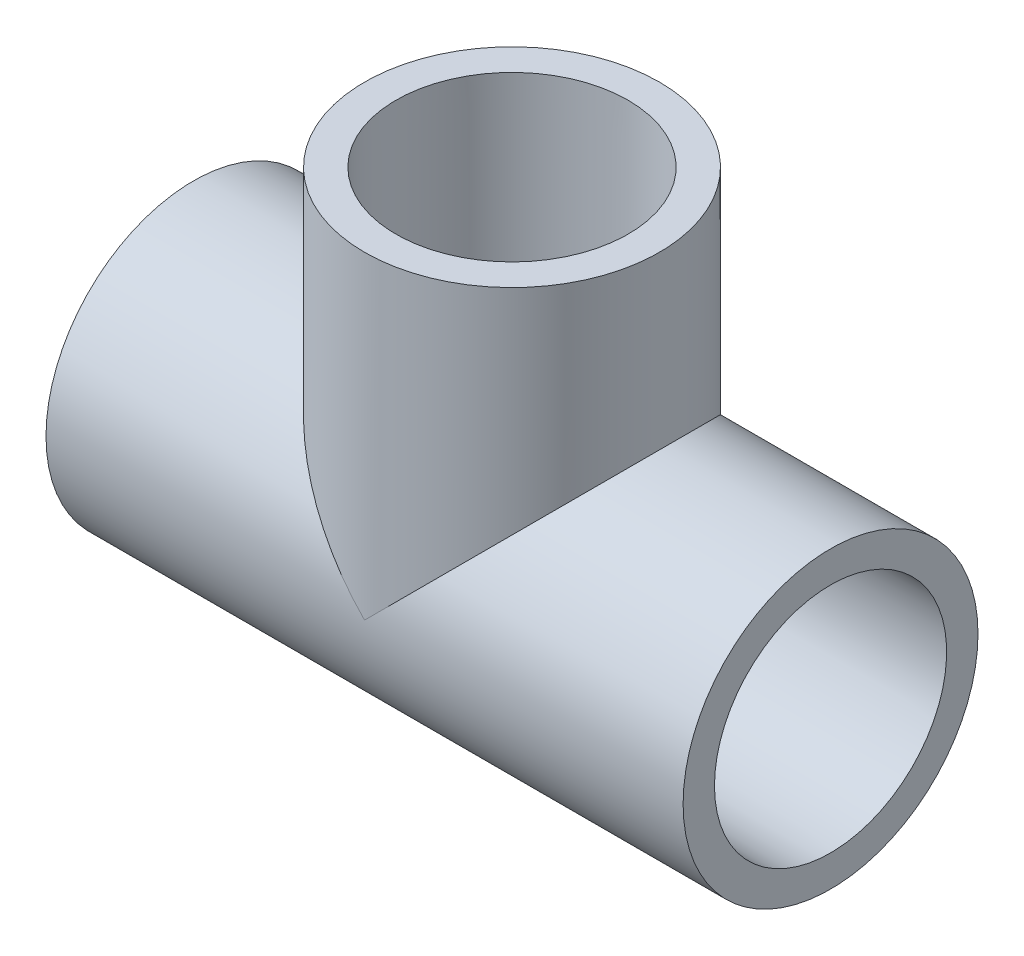
ISO-10303-21;
HEADER;
FILE_DESCRIPTION(('STEP AP214'),'2;1');
FILE_NAME('part.step','',(''),(''),'','','');
FILE_SCHEMA(('AUTOMOTIVE_DESIGN { 1 0 10303 214 1 1 1 1 }'));
ENDSEC;
DATA;
#1=APPLICATION_CONTEXT('core data for automotive mechanical design processes');
#2=APPLICATION_PROTOCOL_DEFINITION('international standard','automotive_design',2000,#1);
#3=PRODUCT_CONTEXT('',#1,'mechanical');
#4=PRODUCT('Part','Part','',(#3));
#5=PRODUCT_RELATED_PRODUCT_CATEGORY('part','',(#4));
#6=PRODUCT_DEFINITION_FORMATION('','',#4);
#7=PRODUCT_DEFINITION_CONTEXT('part definition',#1,'design');
#8=PRODUCT_DEFINITION('design','',#6,#7);
#9=PRODUCT_DEFINITION_SHAPE('','',#8);
#10=(LENGTH_UNIT() NAMED_UNIT(*) SI_UNIT(.MILLI.,.METRE.));
#11=(NAMED_UNIT(*) PLANE_ANGLE_UNIT() SI_UNIT($,.RADIAN.));
#12=(NAMED_UNIT(*) SI_UNIT($,.STERADIAN.) SOLID_ANGLE_UNIT());
#13=UNCERTAINTY_MEASURE_WITH_UNIT(LENGTH_MEASURE(1.E-05),#10,'distance_accuracy_value','');
#14=(GEOMETRIC_REPRESENTATION_CONTEXT(3) GLOBAL_UNCERTAINTY_ASSIGNED_CONTEXT((#13)) GLOBAL_UNIT_ASSIGNED_CONTEXT((#10,
#11,#12)) REPRESENTATION_CONTEXT('',''));
#15=CARTESIAN_POINT('',(0.,0.,0.));
#16=DIRECTION('',(0.,0.,1.));
#17=DIRECTION('',(1.,0.,0.));
#18=AXIS2_PLACEMENT_3D('',#15,#16,#17);
#19=CARTESIAN_POINT('',(-46.1772,0.,0.));
#20=DIRECTION('',(-1.,0.,0.));
#21=DIRECTION('',(0.,0.,1.));
#22=AXIS2_PLACEMENT_3D('',#19,#20,#21);
#23=CYLINDRICAL_SURFACE('',#22,21.3741);
#24=CARTESIAN_POINT('',(-46.1772,0.,0.));
#25=DIRECTION('',(-1.,0.,0.));
#26=DIRECTION('',(0.,0.,1.));
#27=AXIS2_PLACEMENT_3D('',#24,#25,#26);
#28=CIRCLE('',#27,21.3741);
#29=CARTESIAN_POINT('',(-46.1772,0.,21.3741));
#30=VERTEX_POINT('',#29);
#31=EDGE_CURVE('E94',#30,#30,#28,.T.);
#32=ORIENTED_EDGE('',*,*,#31,.F.);
#33=EDGE_LOOP('',(#32));
#34=FACE_BOUND('',#33,.T.);
#35=CARTESIAN_POINT('',(46.1772,0.,0.));
#36=DIRECTION('',(-1.,0.,0.));
#37=DIRECTION('',(0.,0.,1.));
#38=AXIS2_PLACEMENT_3D('',#35,#36,#37);
#39=CIRCLE('',#38,21.3741);
#40=CARTESIAN_POINT('',(46.1772,0.,21.3741));
#41=VERTEX_POINT('',#40);
#42=EDGE_CURVE('E72',#41,#41,#39,.T.);
#43=ORIENTED_EDGE('',*,*,#42,.T.);
#44=EDGE_LOOP('',(#43));
#45=FACE_BOUND('',#44,.T.);
#46=CARTESIAN_POINT('',(0.,0.,0.));
#47=DIRECTION('',(-0.707106781186547,-0.707106781186547,0.));
#48=DIRECTION('',(-0.707106781186547,0.707106781186547,0.));
#49=AXIS2_PLACEMENT_3D('',#46,#47,#48);
#50=ELLIPSE('',#49,30.2275421035188,21.3741);
#51=CARTESIAN_POINT('',(0.,0.,-21.3741));
#52=VERTEX_POINT('',#51);
#53=CARTESIAN_POINT('',(0.,0.,21.3741));
#54=VERTEX_POINT('',#53);
#55=EDGE_CURVE('E49',#52,#54,#50,.F.);
#56=ORIENTED_EDGE('',*,*,#55,.F.);
#57=CARTESIAN_POINT('',(0.,0.,0.));
#58=DIRECTION('',(0.707106781186547,-0.707106781186547,0.));
#59=DIRECTION('',(-0.707106781186547,-0.707106781186547,0.));
#60=AXIS2_PLACEMENT_3D('',#57,#58,#59);
#61=ELLIPSE('',#60,30.2275421035188,21.3741);
#62=EDGE_CURVE('E85',#52,#54,#61,.T.);
#63=ORIENTED_EDGE('',*,*,#62,.T.);
#64=EDGE_LOOP('',(#56,#63));
#65=FACE_BOUND('',#64,.T.);
#66=ADVANCED_FACE('F30',(#34,#45,#65),#23,.T.);
#67=CARTESIAN_POINT('',(-46.1772,-21.3741,0.));
#68=DIRECTION('',(-1.,0.,0.));
#69=DIRECTION('',(0.,0.,1.));
#70=AXIS2_PLACEMENT_3D('',#67,#68,#69);
#71=PLANE('',#70);
#72=ORIENTED_EDGE('',*,*,#31,.T.);
#73=EDGE_LOOP('',(#72));
#74=FACE_BOUND('',#73,.T.);
#75=CARTESIAN_POINT('',(-46.1772,0.,0.));
#76=DIRECTION('',(-1.,0.,0.));
#77=DIRECTION('',(0.,0.,1.));
#78=AXIS2_PLACEMENT_3D('',#75,#76,#77);
#79=CIRCLE('',#78,16.8275);
#80=CARTESIAN_POINT('',(-46.1772,0.,16.8275));
#81=VERTEX_POINT('',#80);
#82=EDGE_CURVE('E102',#81,#81,#79,.T.);
#83=ORIENTED_EDGE('',*,*,#82,.F.);
#84=EDGE_LOOP('',(#83));
#85=FACE_BOUND('',#84,.T.);
#86=ADVANCED_FACE('F32',(#74,#85),#71,.T.);
#87=CARTESIAN_POINT('',(-17.4752,0.,0.));
#88=DIRECTION('',(-1.,0.,0.));
#89=DIRECTION('',(0.,0.,1.));
#90=AXIS2_PLACEMENT_3D('',#87,#88,#89);
#91=CONICAL_SURFACE('',#90,16.637,0.00663707068398975);
#92=ORIENTED_EDGE('',*,*,#82,.T.);
#93=EDGE_LOOP('',(#92));
#94=FACE_BOUND('',#93,.T.);
#95=CARTESIAN_POINT('',(-17.4752,0.,0.));
#96=DIRECTION('',(-1.,0.,0.));
#97=DIRECTION('',(0.,0.,1.));
#98=AXIS2_PLACEMENT_3D('',#95,#96,#97);
#99=CIRCLE('',#98,16.637);
#100=CARTESIAN_POINT('',(-17.4752,0.,16.637));
#101=VERTEX_POINT('',#100);
#102=EDGE_CURVE('E99',#101,#101,#99,.T.);
#103=ORIENTED_EDGE('',*,*,#102,.F.);
#104=EDGE_LOOP('',(#103));
#105=FACE_BOUND('',#104,.T.);
#106=ADVANCED_FACE('F136',(#94,#105),#91,.F.);
#107=CARTESIAN_POINT('',(75.2391741857328,17.4752,-12.3072960381231));
#108=DIRECTION('',(0.,-1.,0.));
#109=DIRECTION('',(0.,0.,-1.));
#110=AXIS2_PLACEMENT_3D('',#107,#108,#109);
#111=PLANE('',#110);
#112=CARTESIAN_POINT('',(0.,17.4752,0.));
#113=DIRECTION('',(0.,1.,0.));
#114=DIRECTION('',(0.,0.,1.));
#115=AXIS2_PLACEMENT_3D('',#112,#113,#114);
#116=CIRCLE('',#115,12.1539);
#117=CARTESIAN_POINT('',(0.,17.4752,12.1539));
#118=VERTEX_POINT('',#117);
#119=EDGE_CURVE('E70',#118,#118,#116,.T.);
#120=ORIENTED_EDGE('',*,*,#119,.F.);
#121=EDGE_LOOP('',(#120));
#122=FACE_BOUND('',#121,.T.);
#123=CARTESIAN_POINT('',(0.,17.4752,0.));
#124=DIRECTION('',(0.,-1.,0.));
#125=DIRECTION('',(0.,0.,-1.));
#126=AXIS2_PLACEMENT_3D('',#123,#124,#125);
#127=CIRCLE('',#126,16.637);
#128=CARTESIAN_POINT('',(0.,17.4752,-16.637));
#129=VERTEX_POINT('',#128);
#130=EDGE_CURVE('E56',#129,#129,#127,.F.);
#131=ORIENTED_EDGE('',*,*,#130,.T.);
#132=EDGE_LOOP('',(#131));
#133=FACE_BOUND('',#132,.T.);
#134=ADVANCED_FACE('F108',(#122,#133),#111,.F.);
#135=CARTESIAN_POINT('',(-17.4752,0.,0.));
#136=DIRECTION('',(1.,0.,0.));
#137=DIRECTION('',(0.,0.,-1.));
#138=AXIS2_PLACEMENT_3D('',#135,#136,#137);
#139=PLANE('',#138);
#140=CARTESIAN_POINT('',(-17.4752,0.,0.));
#141=DIRECTION('',(-1.,0.,0.));
#142=DIRECTION('',(0.,0.,1.));
#143=AXIS2_PLACEMENT_3D('',#140,#141,#142);
#144=CIRCLE('',#143,12.1539);
#145=CARTESIAN_POINT('',(-17.4752,0.,12.1539));
#146=VERTEX_POINT('',#145);
#147=EDGE_CURVE('E68',#146,#146,#144,.T.);
#148=ORIENTED_EDGE('',*,*,#147,.F.);
#149=EDGE_LOOP('',(#148));
#150=FACE_BOUND('',#149,.T.);
#151=ORIENTED_EDGE('',*,*,#102,.T.);
#152=EDGE_LOOP('',(#151));
#153=FACE_BOUND('',#152,.T.);
#154=ADVANCED_FACE('F121',(#150,#153),#139,.F.);
#155=CARTESIAN_POINT('',(21.3741,46.1772,0.));
#156=DIRECTION('',(0.,1.,0.));
#157=DIRECTION('',(0.,0.,1.));
#158=AXIS2_PLACEMENT_3D('',#155,#156,#157);
#159=PLANE('',#158);
#160=CARTESIAN_POINT('',(0.,46.1772,0.));
#161=DIRECTION('',(0.,-1.,0.));
#162=DIRECTION('',(0.,0.,-1.));
#163=AXIS2_PLACEMENT_3D('',#160,#161,#162);
#164=CIRCLE('',#163,16.8275);
#165=CARTESIAN_POINT('',(0.,46.1772,-16.8275));
#166=VERTEX_POINT('',#165);
#167=EDGE_CURVE('E87',#166,#166,#164,.T.);
#168=ORIENTED_EDGE('',*,*,#167,.T.);
#169=EDGE_LOOP('',(#168));
#170=FACE_BOUND('',#169,.T.);
#171=CARTESIAN_POINT('',(0.,46.1772,0.));
#172=DIRECTION('',(0.,-1.,0.));
#173=DIRECTION('',(0.,0.,-1.));
#174=AXIS2_PLACEMENT_3D('',#171,#172,#173);
#175=CIRCLE('',#174,21.3741);
#176=CARTESIAN_POINT('',(0.,46.1772,-21.3741));
#177=VERTEX_POINT('',#176);
#178=EDGE_CURVE('E90',#177,#177,#175,.T.);
#179=ORIENTED_EDGE('',*,*,#178,.F.);
#180=EDGE_LOOP('',(#179));
#181=FACE_BOUND('',#180,.T.);
#182=ADVANCED_FACE('F118',(#170,#181),#159,.T.);
#183=CARTESIAN_POINT('',(0.,0.,0.));
#184=DIRECTION('',(0.,-1.,0.));
#185=DIRECTION('',(0.,0.,-1.));
#186=AXIS2_PLACEMENT_3D('',#183,#184,#185);
#187=CYLINDRICAL_SURFACE('',#186,21.3741);
#188=ORIENTED_EDGE('',*,*,#62,.F.);
#189=ORIENTED_EDGE('',*,*,#55,.T.);
#190=EDGE_LOOP('',(#188,#189));
#191=FACE_BOUND('',#190,.T.);
#192=ORIENTED_EDGE('',*,*,#178,.T.);
#193=EDGE_LOOP('',(#192));
#194=FACE_BOUND('',#193,.T.);
#195=ADVANCED_FACE('F114',(#191,#194),#187,.T.);
#196=CARTESIAN_POINT('',(0.,46.1772,0.));
#197=DIRECTION('',(0.,1.,0.));
#198=DIRECTION('',(0.,0.,1.));
#199=AXIS2_PLACEMENT_3D('',#196,#197,#198);
#200=CONICAL_SURFACE('',#199,16.8275,0.00663707068398975);
#201=ORIENTED_EDGE('',*,*,#130,.F.);
#202=EDGE_LOOP('',(#201));
#203=FACE_BOUND('',#202,.T.);
#204=ORIENTED_EDGE('',*,*,#167,.F.);
#205=EDGE_LOOP('',(#204));
#206=FACE_BOUND('',#205,.T.);
#207=ADVANCED_FACE('F110',(#203,#206),#200,.F.);
#208=CARTESIAN_POINT('',(46.1772,-21.3741,0.));
#209=DIRECTION('',(1.,0.,0.));
#210=DIRECTION('',(0.,0.,1.));
#211=AXIS2_PLACEMENT_3D('',#208,#209,#210);
#212=PLANE('',#211);
#213=ORIENTED_EDGE('',*,*,#42,.F.);
#214=EDGE_LOOP('',(#213));
#215=FACE_BOUND('',#214,.T.);
#216=CARTESIAN_POINT('',(46.1772,0.,0.));
#217=DIRECTION('',(-1.,0.,0.));
#218=DIRECTION('',(0.,0.,1.));
#219=AXIS2_PLACEMENT_3D('',#216,#217,#218);
#220=CIRCLE('',#219,16.8275);
#221=CARTESIAN_POINT('',(46.1772,0.,16.8275));
#222=VERTEX_POINT('',#221);
#223=EDGE_CURVE('E82',#222,#222,#220,.T.);
#224=ORIENTED_EDGE('',*,*,#223,.T.);
#225=EDGE_LOOP('',(#224));
#226=FACE_BOUND('',#225,.T.);
#227=ADVANCED_FACE('F113',(#215,#226),#212,.T.);
#228=CARTESIAN_POINT('',(17.4752,0.,0.));
#229=DIRECTION('',(1.,0.,0.));
#230=DIRECTION('',(0.,0.,1.));
#231=AXIS2_PLACEMENT_3D('',#228,#229,#230);
#232=CONICAL_SURFACE('',#231,16.637,0.00663707068398975);
#233=ORIENTED_EDGE('',*,*,#223,.F.);
#234=EDGE_LOOP('',(#233));
#235=FACE_BOUND('',#234,.T.);
#236=CARTESIAN_POINT('',(17.4752,0.,0.));
#237=DIRECTION('',(-1.,0.,0.));
#238=DIRECTION('',(0.,0.,1.));
#239=AXIS2_PLACEMENT_3D('',#236,#237,#238);
#240=CIRCLE('',#239,16.637);
#241=CARTESIAN_POINT('',(17.4752,0.,16.637));
#242=VERTEX_POINT('',#241);
#243=EDGE_CURVE('E79',#242,#242,#240,.T.);
#244=ORIENTED_EDGE('',*,*,#243,.T.);
#245=EDGE_LOOP('',(#244));
#246=FACE_BOUND('',#245,.T.);
#247=ADVANCED_FACE('F157',(#235,#246),#232,.F.);
#248=CARTESIAN_POINT('',(17.4752,-21.3741,0.));
#249=DIRECTION('',(-1.,0.,0.));
#250=DIRECTION('',(0.,0.,-1.));
#251=AXIS2_PLACEMENT_3D('',#248,#249,#250);
#252=PLANE('',#251);
#253=CARTESIAN_POINT('',(17.4752,0.,0.));
#254=DIRECTION('',(-1.,0.,0.));
#255=DIRECTION('',(0.,0.,1.));
#256=AXIS2_PLACEMENT_3D('',#253,#254,#255);
#257=CIRCLE('',#256,12.1539);
#258=CARTESIAN_POINT('',(17.4752,0.,12.1539));
#259=VERTEX_POINT('',#258);
#260=EDGE_CURVE('E65',#259,#259,#257,.F.);
#261=ORIENTED_EDGE('',*,*,#260,.F.);
#262=EDGE_LOOP('',(#261));
#263=FACE_BOUND('',#262,.T.);
#264=ORIENTED_EDGE('',*,*,#243,.F.);
#265=EDGE_LOOP('',(#264));
#266=FACE_BOUND('',#265,.T.);
#267=ADVANCED_FACE('F60',(#263,#266),#252,.F.);
#268=CARTESIAN_POINT('',(51.8516204314527,0.,0.));
#269=DIRECTION('',(-1.,0.,0.));
#270=DIRECTION('',(0.,0.,1.));
#271=AXIS2_PLACEMENT_3D('',#268,#269,#270);
#272=CYLINDRICAL_SURFACE('',#271,12.1539);
#273=CARTESIAN_POINT('',(0.,0.,0.));
#274=DIRECTION('',(-0.707106781186547,-0.707106781186547,0.));
#275=DIRECTION('',(-0.707106781186547,0.707106781186547,0.));
#276=AXIS2_PLACEMENT_3D('',#273,#274,#275);
#277=ELLIPSE('',#276,17.1882102157264,12.1539);
#278=CARTESIAN_POINT('',(0.,0.,-12.1539));
#279=VERTEX_POINT('',#278);
#280=CARTESIAN_POINT('',(0.,0.,12.1539));
#281=VERTEX_POINT('',#280);
#282=EDGE_CURVE('E38',#279,#281,#277,.F.);
#283=ORIENTED_EDGE('',*,*,#282,.T.);
#284=CARTESIAN_POINT('',(0.,0.,0.));
#285=DIRECTION('',(-0.707106781186547,0.707106781186547,0.));
#286=DIRECTION('',(-0.707106781186547,-0.707106781186547,0.));
#287=AXIS2_PLACEMENT_3D('',#284,#285,#286);
#288=ELLIPSE('',#287,17.1882102157264,12.1539);
#289=EDGE_CURVE('E11',#281,#279,#288,.T.);
#290=ORIENTED_EDGE('',*,*,#289,.T.);
#291=EDGE_LOOP('',(#283,#290));
#292=FACE_BOUND('',#291,.T.);
#293=ORIENTED_EDGE('',*,*,#260,.T.);
#294=EDGE_LOOP('',(#293));
#295=FACE_BOUND('',#294,.T.);
#296=ORIENTED_EDGE('',*,*,#147,.T.);
#297=EDGE_LOOP('',(#296));
#298=FACE_BOUND('',#297,.T.);
#299=ADVANCED_FACE('F57',(#292,#295,#298),#272,.F.);
#300=CARTESIAN_POINT('',(0.,0.,0.));
#301=DIRECTION('',(0.,1.,0.));
#302=DIRECTION('',(0.,0.,1.));
#303=AXIS2_PLACEMENT_3D('',#300,#301,#302);
#304=CYLINDRICAL_SURFACE('',#303,12.1539);
#305=ORIENTED_EDGE('',*,*,#119,.T.);
#306=EDGE_LOOP('',(#305));
#307=FACE_BOUND('',#306,.T.);
#308=ORIENTED_EDGE('',*,*,#282,.F.);
#309=ORIENTED_EDGE('',*,*,#289,.F.);
#310=EDGE_LOOP('',(#308,#309));
#311=FACE_BOUND('',#310,.T.);
#312=ADVANCED_FACE('F54',(#307,#311),#304,.F.);
#313=CLOSED_SHELL('',(#66,#86,#106,#134,#154,#182,#195,#207,#227,#247,#267,#299,#312));
#314=MANIFOLD_SOLID_BREP('B2',#313);
#315=ADVANCED_BREP_SHAPE_REPRESENTATION('',(#18,#314),#14);
#316=SHAPE_DEFINITION_REPRESENTATION(#9,#315);
ENDSEC;
END-ISO-10303-21;
